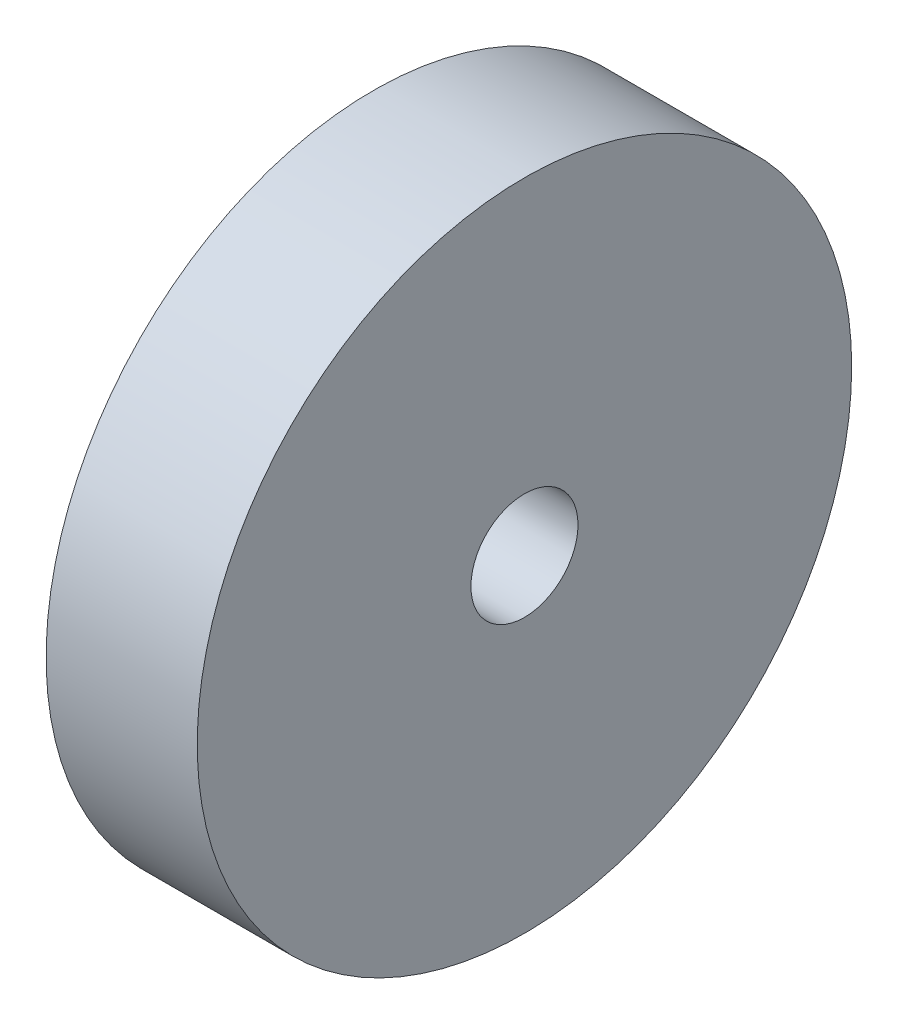
ISO-10303-21;
HEADER;
FILE_DESCRIPTION(('STEP AP214'),'2;1');
FILE_NAME('part.step','',(''),(''),'','','');
FILE_SCHEMA(('AUTOMOTIVE_DESIGN { 1 0 10303 214 1 1 1 1 }'));
ENDSEC;
DATA;
#1=APPLICATION_CONTEXT('core data for automotive mechanical design processes');
#2=APPLICATION_PROTOCOL_DEFINITION('international standard','automotive_design',2000,#1);
#3=PRODUCT_CONTEXT('',#1,'mechanical');
#4=PRODUCT('Part','Part','',(#3));
#5=PRODUCT_RELATED_PRODUCT_CATEGORY('part','',(#4));
#6=PRODUCT_DEFINITION_FORMATION('','',#4);
#7=PRODUCT_DEFINITION_CONTEXT('part definition',#1,'design');
#8=PRODUCT_DEFINITION('design','',#6,#7);
#9=PRODUCT_DEFINITION_SHAPE('','',#8);
#10=(LENGTH_UNIT() NAMED_UNIT(*) SI_UNIT(.MILLI.,.METRE.));
#11=(NAMED_UNIT(*) PLANE_ANGLE_UNIT() SI_UNIT($,.RADIAN.));
#12=(NAMED_UNIT(*) SI_UNIT($,.STERADIAN.) SOLID_ANGLE_UNIT());
#13=UNCERTAINTY_MEASURE_WITH_UNIT(LENGTH_MEASURE(1.E-05),#10,'distance_accuracy_value','');
#14=(GEOMETRIC_REPRESENTATION_CONTEXT(3) GLOBAL_UNCERTAINTY_ASSIGNED_CONTEXT((#13)) GLOBAL_UNIT_ASSIGNED_CONTEXT((#10,
#11,#12)) REPRESENTATION_CONTEXT('',''));
#15=CARTESIAN_POINT('',(0.,0.,0.));
#16=DIRECTION('',(0.,0.,1.));
#17=DIRECTION('',(1.,0.,0.));
#18=AXIS2_PLACEMENT_3D('',#15,#16,#17);
#19=CARTESIAN_POINT('',(5.08,0.,0.));
#20=DIRECTION('',(-1.,0.,0.));
#21=DIRECTION('',(0.,0.,1.));
#22=AXIS2_PLACEMENT_3D('',#19,#20,#21);
#23=CYLINDRICAL_SURFACE('',#22,11.);
#24=CARTESIAN_POINT('',(5.08,0.,0.));
#25=DIRECTION('',(1.,0.,0.));
#26=DIRECTION('',(0.,0.,-1.));
#27=AXIS2_PLACEMENT_3D('',#24,#25,#26);
#28=CIRCLE('',#27,11.);
#29=CARTESIAN_POINT('',(5.08,0.,-11.));
#30=VERTEX_POINT('',#29);
#31=EDGE_CURVE('E12',#30,#30,#28,.T.);
#32=ORIENTED_EDGE('',*,*,#31,.F.);
#33=EDGE_LOOP('',(#32));
#34=FACE_BOUND('',#33,.T.);
#35=CARTESIAN_POINT('',(0.,0.,0.));
#36=DIRECTION('',(1.,0.,0.));
#37=DIRECTION('',(0.,0.,-1.));
#38=AXIS2_PLACEMENT_3D('',#35,#36,#37);
#39=CIRCLE('',#38,11.);
#40=CARTESIAN_POINT('',(0.,0.,-11.));
#41=VERTEX_POINT('',#40);
#42=EDGE_CURVE('E46',#41,#41,#39,.T.);
#43=ORIENTED_EDGE('',*,*,#42,.T.);
#44=EDGE_LOOP('',(#43));
#45=FACE_BOUND('',#44,.T.);
#46=ADVANCED_FACE('F43',(#34,#45),#23,.T.);
#47=CARTESIAN_POINT('',(5.08,0.,0.));
#48=DIRECTION('',(1.,0.,0.));
#49=DIRECTION('',(0.,0.,-1.));
#50=AXIS2_PLACEMENT_3D('',#47,#48,#49);
#51=PLANE('',#50);
#52=CARTESIAN_POINT('',(5.08,0.,0.));
#53=DIRECTION('',(1.,0.,0.));
#54=DIRECTION('',(0.,0.,-1.));
#55=AXIS2_PLACEMENT_3D('',#52,#53,#54);
#56=CIRCLE('',#55,1.79999999999999);
#57=CARTESIAN_POINT('',(5.08,0.,-1.79999999999999));
#58=VERTEX_POINT('',#57);
#59=EDGE_CURVE('E53',#58,#58,#56,.T.);
#60=ORIENTED_EDGE('',*,*,#59,.F.);
#61=EDGE_LOOP('',(#60));
#62=FACE_BOUND('',#61,.T.);
#63=ORIENTED_EDGE('',*,*,#31,.T.);
#64=EDGE_LOOP('',(#63));
#65=FACE_BOUND('',#64,.T.);
#66=ADVANCED_FACE('F67',(#62,#65),#51,.T.);
#67=CARTESIAN_POINT('',(0.,0.,0.));
#68=DIRECTION('',(1.,0.,0.));
#69=DIRECTION('',(0.,0.,-1.));
#70=AXIS2_PLACEMENT_3D('',#67,#68,#69);
#71=PLANE('',#70);
#72=CARTESIAN_POINT('',(0.,0.,0.));
#73=DIRECTION('',(-1.,0.,0.));
#74=DIRECTION('',(0.,0.,1.));
#75=AXIS2_PLACEMENT_3D('',#72,#73,#74);
#76=CIRCLE('',#75,1.79999999999999);
#77=CARTESIAN_POINT('',(0.,0.,1.79999999999999));
#78=VERTEX_POINT('',#77);
#79=EDGE_CURVE('E57',#78,#78,#76,.T.);
#80=ORIENTED_EDGE('',*,*,#79,.F.);
#81=EDGE_LOOP('',(#80));
#82=FACE_BOUND('',#81,.T.);
#83=ORIENTED_EDGE('',*,*,#42,.F.);
#84=EDGE_LOOP('',(#83));
#85=FACE_BOUND('',#84,.T.);
#86=ADVANCED_FACE('F64',(#82,#85),#71,.F.);
#87=CARTESIAN_POINT('',(0.,0.,0.));
#88=DIRECTION('',(-1.,0.,0.));
#89=DIRECTION('',(0.,0.,1.));
#90=AXIS2_PLACEMENT_3D('',#87,#88,#89);
#91=CYLINDRICAL_SURFACE('',#90,1.79999999999999);
#92=ORIENTED_EDGE('',*,*,#79,.T.);
#93=EDGE_LOOP('',(#92));
#94=FACE_BOUND('',#93,.T.);
#95=ORIENTED_EDGE('',*,*,#59,.T.);
#96=EDGE_LOOP('',(#95));
#97=FACE_BOUND('',#96,.T.);
#98=ADVANCED_FACE('F61',(#94,#97),#91,.F.);
#99=CLOSED_SHELL('',(#46,#66,#86,#98));
#100=MANIFOLD_SOLID_BREP('B2',#99);
#101=ADVANCED_BREP_SHAPE_REPRESENTATION('',(#18,#100),#14);
#102=SHAPE_DEFINITION_REPRESENTATION(#9,#101);
ENDSEC;
END-ISO-10303-21;
